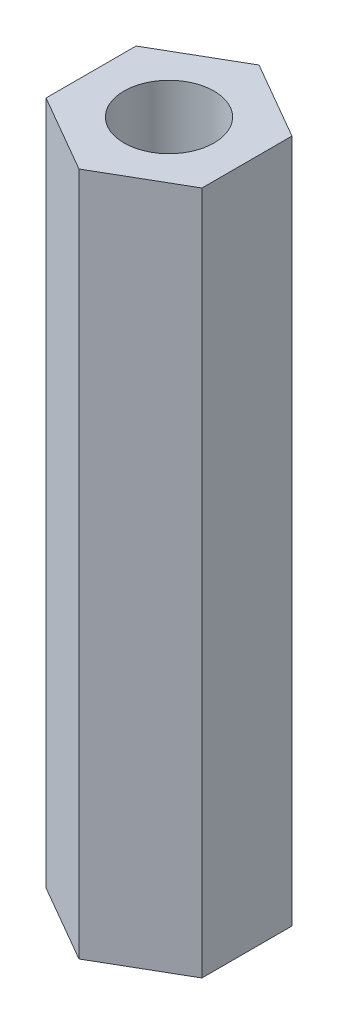
ISO-10303-21;
HEADER;
FILE_DESCRIPTION(('STEP AP214'),'2;1');
FILE_NAME('part.step','',(''),(''),'','','');
FILE_SCHEMA(('AUTOMOTIVE_DESIGN { 1 0 10303 214 1 1 1 1 }'));
ENDSEC;
DATA;
#1=APPLICATION_CONTEXT('core data for automotive mechanical design processes');
#2=APPLICATION_PROTOCOL_DEFINITION('international standard','automotive_design',2000,#1);
#3=PRODUCT_CONTEXT('',#1,'mechanical');
#4=PRODUCT('Part','Part','',(#3));
#5=PRODUCT_RELATED_PRODUCT_CATEGORY('part','',(#4));
#6=PRODUCT_DEFINITION_FORMATION('','',#4);
#7=PRODUCT_DEFINITION_CONTEXT('part definition',#1,'design');
#8=PRODUCT_DEFINITION('design','',#6,#7);
#9=PRODUCT_DEFINITION_SHAPE('','',#8);
#10=(LENGTH_UNIT() NAMED_UNIT(*) SI_UNIT(.MILLI.,.METRE.));
#11=(NAMED_UNIT(*) PLANE_ANGLE_UNIT() SI_UNIT($,.RADIAN.));
#12=(NAMED_UNIT(*) SI_UNIT($,.STERADIAN.) SOLID_ANGLE_UNIT());
#13=UNCERTAINTY_MEASURE_WITH_UNIT(LENGTH_MEASURE(1.E-05),#10,'distance_accuracy_value','');
#14=(GEOMETRIC_REPRESENTATION_CONTEXT(3) GLOBAL_UNCERTAINTY_ASSIGNED_CONTEXT((#13)) GLOBAL_UNIT_ASSIGNED_CONTEXT((#10,
#11,#12)) REPRESENTATION_CONTEXT('',''));
#15=CARTESIAN_POINT('',(0.,0.,0.));
#16=DIRECTION('',(0.,0.,1.));
#17=DIRECTION('',(1.,0.,0.));
#18=AXIS2_PLACEMENT_3D('',#15,#16,#17);
#19=CARTESIAN_POINT('',(0.,38.,-5.));
#20=DIRECTION('',(0.,1.,0.));
#21=DIRECTION('',(0.,0.,1.));
#22=AXIS2_PLACEMENT_3D('',#19,#20,#21);
#23=PLANE('',#22);
#24=DIRECTION('',(-0.866025403784439,0.,-0.5));
#25=VECTOR('',#24,1.);
#26=CARTESIAN_POINT('',(4.33012701892219,38.,-2.5));
#27=LINE('',#26,#25);
#28=CARTESIAN_POINT('',(4.33012701892219,38.,-2.5));
#29=VERTEX_POINT('',#28);
#30=CARTESIAN_POINT('',(0.,38.,-5.));
#31=VERTEX_POINT('',#30);
#32=EDGE_CURVE('E126',#29,#31,#27,.T.);
#33=ORIENTED_EDGE('',*,*,#32,.T.);
#34=DIRECTION('',(-0.866025403784439,0.,0.5));
#35=VECTOR('',#34,1.);
#36=CARTESIAN_POINT('',(0.,38.,-5.));
#37=LINE('',#36,#35);
#38=CARTESIAN_POINT('',(-4.33012701892219,38.,-2.5));
#39=VERTEX_POINT('',#38);
#40=EDGE_CURVE('E84',#31,#39,#37,.T.);
#41=ORIENTED_EDGE('',*,*,#40,.T.);
#42=DIRECTION('',(0.,0.,1.));
#43=VECTOR('',#42,1.);
#44=CARTESIAN_POINT('',(-4.33012701892219,38.,-2.5));
#45=LINE('',#44,#43);
#46=CARTESIAN_POINT('',(-4.33012701892219,38.,2.5));
#47=VERTEX_POINT('',#46);
#48=EDGE_CURVE('E97',#39,#47,#45,.T.);
#49=ORIENTED_EDGE('',*,*,#48,.T.);
#50=DIRECTION('',(0.866025403784439,0.,0.5));
#51=VECTOR('',#50,1.);
#52=CARTESIAN_POINT('',(-4.33012701892219,38.,2.5));
#53=LINE('',#52,#51);
#54=CARTESIAN_POINT('',(0.,38.,5.));
#55=VERTEX_POINT('',#54);
#56=EDGE_CURVE('E91',#47,#55,#53,.T.);
#57=ORIENTED_EDGE('',*,*,#56,.T.);
#58=DIRECTION('',(0.866025403784439,0.,-0.5));
#59=VECTOR('',#58,1.);
#60=CARTESIAN_POINT('',(0.,38.,5.));
#61=LINE('',#60,#59);
#62=CARTESIAN_POINT('',(4.33012701892219,38.,2.5));
#63=VERTEX_POINT('',#62);
#64=EDGE_CURVE('E95',#55,#63,#61,.T.);
#65=ORIENTED_EDGE('',*,*,#64,.T.);
#66=DIRECTION('',(0.,0.,-1.));
#67=VECTOR('',#66,1.);
#68=CARTESIAN_POINT('',(4.33012701892219,38.,2.5));
#69=LINE('',#68,#67);
#70=EDGE_CURVE('E47',#63,#29,#69,.T.);
#71=ORIENTED_EDGE('',*,*,#70,.T.);
#72=EDGE_LOOP('',(#33,#41,#49,#57,#65,#71));
#73=FACE_BOUND('',#72,.T.);
#74=CARTESIAN_POINT('',(0.,38.,0.));
#75=DIRECTION('',(0.,1.,0.));
#76=DIRECTION('',(0.,0.,1.));
#77=AXIS2_PLACEMENT_3D('',#74,#75,#76);
#78=CIRCLE('',#77,2.5);
#79=CARTESIAN_POINT('',(0.,38.,2.5));
#80=VERTEX_POINT('',#79);
#81=EDGE_CURVE('E119',#80,#80,#78,.T.);
#82=ORIENTED_EDGE('',*,*,#81,.F.);
#83=EDGE_LOOP('',(#82));
#84=FACE_BOUND('',#83,.T.);
#85=ADVANCED_FACE('F30',(#73,#84),#23,.T.);
#86=CARTESIAN_POINT('',(0.,0.,-5.));
#87=DIRECTION('',(0.,1.,0.));
#88=DIRECTION('',(0.,0.,1.));
#89=AXIS2_PLACEMENT_3D('',#86,#87,#88);
#90=PLANE('',#89);
#91=DIRECTION('',(-0.866025403784439,0.,-0.5));
#92=VECTOR('',#91,1.);
#93=CARTESIAN_POINT('',(4.33012701892219,0.,-2.5));
#94=LINE('',#93,#92);
#95=CARTESIAN_POINT('',(4.33012701892219,0.,-2.5));
#96=VERTEX_POINT('',#95);
#97=CARTESIAN_POINT('',(0.,0.,-5.));
#98=VERTEX_POINT('',#97);
#99=EDGE_CURVE('E115',#96,#98,#94,.T.);
#100=ORIENTED_EDGE('',*,*,#99,.F.);
#101=DIRECTION('',(0.,0.,-1.));
#102=VECTOR('',#101,1.);
#103=CARTESIAN_POINT('',(4.33012701892219,0.,2.5));
#104=LINE('',#103,#102);
#105=CARTESIAN_POINT('',(4.33012701892219,0.,2.5));
#106=VERTEX_POINT('',#105);
#107=EDGE_CURVE('E76',#106,#96,#104,.T.);
#108=ORIENTED_EDGE('',*,*,#107,.F.);
#109=DIRECTION('',(0.866025403784439,0.,-0.5));
#110=VECTOR('',#109,1.);
#111=CARTESIAN_POINT('',(0.,0.,5.));
#112=LINE('',#111,#110);
#113=CARTESIAN_POINT('',(0.,0.,5.));
#114=VERTEX_POINT('',#113);
#115=EDGE_CURVE('E70',#114,#106,#112,.T.);
#116=ORIENTED_EDGE('',*,*,#115,.F.);
#117=DIRECTION('',(0.866025403784439,0.,0.5));
#118=VECTOR('',#117,1.);
#119=CARTESIAN_POINT('',(-4.33012701892219,0.,2.5));
#120=LINE('',#119,#118);
#121=CARTESIAN_POINT('',(-4.33012701892219,0.,2.5));
#122=VERTEX_POINT('',#121);
#123=EDGE_CURVE('E105',#122,#114,#120,.T.);
#124=ORIENTED_EDGE('',*,*,#123,.F.);
#125=DIRECTION('',(0.,0.,1.));
#126=VECTOR('',#125,1.);
#127=CARTESIAN_POINT('',(-4.33012701892219,0.,-2.5));
#128=LINE('',#127,#126);
#129=CARTESIAN_POINT('',(-4.33012701892219,0.,-2.5));
#130=VERTEX_POINT('',#129);
#131=EDGE_CURVE('E121',#130,#122,#128,.T.);
#132=ORIENTED_EDGE('',*,*,#131,.F.);
#133=DIRECTION('',(-0.866025403784439,0.,0.5));
#134=VECTOR('',#133,1.);
#135=CARTESIAN_POINT('',(0.,0.,-5.));
#136=LINE('',#135,#134);
#137=EDGE_CURVE('E118',#98,#130,#136,.T.);
#138=ORIENTED_EDGE('',*,*,#137,.F.);
#139=EDGE_LOOP('',(#100,#108,#116,#124,#132,#138));
#140=FACE_BOUND('',#139,.T.);
#141=CARTESIAN_POINT('',(0.,0.,0.));
#142=DIRECTION('',(0.,1.,0.));
#143=DIRECTION('',(0.,0.,1.));
#144=AXIS2_PLACEMENT_3D('',#141,#142,#143);
#145=CIRCLE('',#144,2.5);
#146=CARTESIAN_POINT('',(0.,0.,2.5));
#147=VERTEX_POINT('',#146);
#148=EDGE_CURVE('E219',#147,#147,#145,.T.);
#149=ORIENTED_EDGE('',*,*,#148,.T.);
#150=EDGE_LOOP('',(#149));
#151=FACE_BOUND('',#150,.T.);
#152=ADVANCED_FACE('F135',(#140,#151),#90,.F.);
#153=CARTESIAN_POINT('',(4.33012701892219,38.,-2.5));
#154=DIRECTION('',(-0.5,0.,0.866025403784439));
#155=DIRECTION('',(0.866025403784439,0.,0.5));
#156=AXIS2_PLACEMENT_3D('',#153,#154,#155);
#157=PLANE('',#156);
#158=ORIENTED_EDGE('',*,*,#99,.T.);
#159=DIRECTION('',(0.,-1.,0.));
#160=VECTOR('',#159,1.);
#161=CARTESIAN_POINT('',(0.,38.,-5.));
#162=LINE('',#161,#160);
#163=EDGE_CURVE('E11',#31,#98,#162,.T.);
#164=ORIENTED_EDGE('',*,*,#163,.F.);
#165=ORIENTED_EDGE('',*,*,#32,.F.);
#166=DIRECTION('',(0.,-1.,0.));
#167=VECTOR('',#166,1.);
#168=CARTESIAN_POINT('',(4.33012701892219,38.,-2.5));
#169=LINE('',#168,#167);
#170=EDGE_CURVE('E111',#29,#96,#169,.T.);
#171=ORIENTED_EDGE('',*,*,#170,.T.);
#172=EDGE_LOOP('',(#158,#164,#165,#171));
#173=FACE_BOUND('',#172,.T.);
#174=ADVANCED_FACE('F32',(#173),#157,.F.);
#175=CARTESIAN_POINT('',(0.,38.,-5.));
#176=DIRECTION('',(0.5,0.,0.866025403784439));
#177=DIRECTION('',(0.866025403784439,0.,-0.5));
#178=AXIS2_PLACEMENT_3D('',#175,#176,#177);
#179=PLANE('',#178);
#180=ORIENTED_EDGE('',*,*,#137,.T.);
#181=DIRECTION('',(0.,-1.,0.));
#182=VECTOR('',#181,1.);
#183=CARTESIAN_POINT('',(-4.33012701892219,38.,-2.5));
#184=LINE('',#183,#182);
#185=EDGE_CURVE('E39',#39,#130,#184,.T.);
#186=ORIENTED_EDGE('',*,*,#185,.F.);
#187=ORIENTED_EDGE('',*,*,#40,.F.);
#188=ORIENTED_EDGE('',*,*,#163,.T.);
#189=EDGE_LOOP('',(#180,#186,#187,#188));
#190=FACE_BOUND('',#189,.T.);
#191=ADVANCED_FACE('F160',(#190),#179,.F.);
#192=CARTESIAN_POINT('',(-4.33012701892219,38.,-2.5));
#193=DIRECTION('',(1.,0.,0.));
#194=DIRECTION('',(0.,0.,-1.));
#195=AXIS2_PLACEMENT_3D('',#192,#193,#194);
#196=PLANE('',#195);
#197=ORIENTED_EDGE('',*,*,#131,.T.);
#198=DIRECTION('',(0.,-1.,0.));
#199=VECTOR('',#198,1.);
#200=CARTESIAN_POINT('',(-4.33012701892219,38.,2.5));
#201=LINE('',#200,#199);
#202=EDGE_CURVE('E106',#47,#122,#201,.T.);
#203=ORIENTED_EDGE('',*,*,#202,.F.);
#204=ORIENTED_EDGE('',*,*,#48,.F.);
#205=ORIENTED_EDGE('',*,*,#185,.T.);
#206=EDGE_LOOP('',(#197,#203,#204,#205));
#207=FACE_BOUND('',#206,.T.);
#208=ADVANCED_FACE('F132',(#207),#196,.F.);
#209=CARTESIAN_POINT('',(-4.33012701892219,38.,2.5));
#210=DIRECTION('',(0.5,0.,-0.866025403784439));
#211=DIRECTION('',(-0.866025403784439,0.,-0.5));
#212=AXIS2_PLACEMENT_3D('',#209,#210,#211);
#213=PLANE('',#212);
#214=ORIENTED_EDGE('',*,*,#123,.T.);
#215=DIRECTION('',(0.,-1.,0.));
#216=VECTOR('',#215,1.);
#217=CARTESIAN_POINT('',(0.,38.,5.));
#218=LINE('',#217,#216);
#219=EDGE_CURVE('E102',#55,#114,#218,.T.);
#220=ORIENTED_EDGE('',*,*,#219,.F.);
#221=ORIENTED_EDGE('',*,*,#56,.F.);
#222=ORIENTED_EDGE('',*,*,#202,.T.);
#223=EDGE_LOOP('',(#214,#220,#221,#222));
#224=FACE_BOUND('',#223,.T.);
#225=ADVANCED_FACE('F103',(#224),#213,.F.);
#226=CARTESIAN_POINT('',(0.,38.,5.));
#227=DIRECTION('',(-0.5,0.,-0.866025403784439));
#228=DIRECTION('',(-0.866025403784439,0.,0.5));
#229=AXIS2_PLACEMENT_3D('',#226,#227,#228);
#230=PLANE('',#229);
#231=ORIENTED_EDGE('',*,*,#115,.T.);
#232=DIRECTION('',(0.,-1.,0.));
#233=VECTOR('',#232,1.);
#234=CARTESIAN_POINT('',(4.33012701892219,38.,2.5));
#235=LINE('',#234,#233);
#236=EDGE_CURVE('E107',#63,#106,#235,.T.);
#237=ORIENTED_EDGE('',*,*,#236,.F.);
#238=ORIENTED_EDGE('',*,*,#64,.F.);
#239=ORIENTED_EDGE('',*,*,#219,.T.);
#240=EDGE_LOOP('',(#231,#237,#238,#239));
#241=FACE_BOUND('',#240,.T.);
#242=ADVANCED_FACE('F109',(#241),#230,.F.);
#243=CARTESIAN_POINT('',(4.33012701892219,38.,2.5));
#244=DIRECTION('',(-1.,0.,0.));
#245=DIRECTION('',(0.,0.,1.));
#246=AXIS2_PLACEMENT_3D('',#243,#244,#245);
#247=PLANE('',#246);
#248=ORIENTED_EDGE('',*,*,#107,.T.);
#249=ORIENTED_EDGE('',*,*,#170,.F.);
#250=ORIENTED_EDGE('',*,*,#70,.F.);
#251=ORIENTED_EDGE('',*,*,#236,.T.);
#252=EDGE_LOOP('',(#248,#249,#250,#251));
#253=FACE_BOUND('',#252,.T.);
#254=ADVANCED_FACE('F140',(#253),#247,.F.);
#255=CARTESIAN_POINT('',(0.,38.,0.));
#256=DIRECTION('',(0.,-1.,0.));
#257=DIRECTION('',(0.,0.,-1.));
#258=AXIS2_PLACEMENT_3D('',#255,#256,#257);
#259=CYLINDRICAL_SURFACE('',#258,2.5);
#260=ORIENTED_EDGE('',*,*,#81,.T.);
#261=EDGE_LOOP('',(#260));
#262=FACE_BOUND('',#261,.T.);
#263=ORIENTED_EDGE('',*,*,#148,.F.);
#264=EDGE_LOOP('',(#263));
#265=FACE_BOUND('',#264,.T.);
#266=ADVANCED_FACE('F142',(#262,#265),#259,.F.);
#267=CLOSED_SHELL('',(#85,#152,#174,#191,#208,#225,#242,#254,#266));
#268=MANIFOLD_SOLID_BREP('B2',#267);
#269=ADVANCED_BREP_SHAPE_REPRESENTATION('',(#18,#268),#14);
#270=SHAPE_DEFINITION_REPRESENTATION(#9,#269);
ENDSEC;
END-ISO-10303-21;
